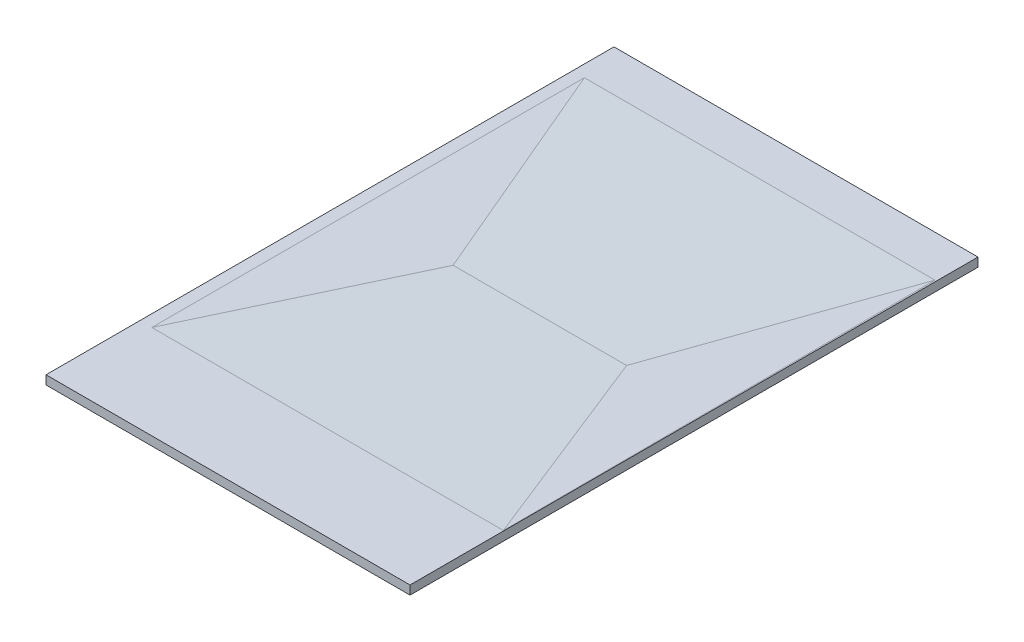
ISO-10303-21;
HEADER;
FILE_DESCRIPTION(('STEP AP214'),'2;1');
FILE_NAME('part.step','',(''),(''),'','','');
FILE_SCHEMA(('AUTOMOTIVE_DESIGN { 1 0 10303 214 1 1 1 1 }'));
ENDSEC;
DATA;
#1=APPLICATION_CONTEXT('core data for automotive mechanical design processes');
#2=APPLICATION_PROTOCOL_DEFINITION('international standard','automotive_design',2000,#1);
#3=PRODUCT_CONTEXT('',#1,'mechanical');
#4=PRODUCT('Part','Part','',(#3));
#5=PRODUCT_RELATED_PRODUCT_CATEGORY('part','',(#4));
#6=PRODUCT_DEFINITION_FORMATION('','',#4);
#7=PRODUCT_DEFINITION_CONTEXT('part definition',#1,'design');
#8=PRODUCT_DEFINITION('design','',#6,#7);
#9=PRODUCT_DEFINITION_SHAPE('','',#8);
#10=(LENGTH_UNIT() NAMED_UNIT(*) SI_UNIT(.MILLI.,.METRE.));
#11=(NAMED_UNIT(*) PLANE_ANGLE_UNIT() SI_UNIT($,.RADIAN.));
#12=(NAMED_UNIT(*) SI_UNIT($,.STERADIAN.) SOLID_ANGLE_UNIT());
#13=UNCERTAINTY_MEASURE_WITH_UNIT(LENGTH_MEASURE(1.E-05),#10,'distance_accuracy_value','');
#14=(GEOMETRIC_REPRESENTATION_CONTEXT(3) GLOBAL_UNCERTAINTY_ASSIGNED_CONTEXT((#13)) GLOBAL_UNIT_ASSIGNED_CONTEXT((#10,
#11,#12)) REPRESENTATION_CONTEXT('',''));
#15=CARTESIAN_POINT('',(0.,0.,0.));
#16=DIRECTION('',(0.,0.,1.));
#17=DIRECTION('',(1.,0.,0.));
#18=AXIS2_PLACEMENT_3D('',#15,#16,#17);
#19=CARTESIAN_POINT('',(-1695.2888489925,500.,4954.63050108021));
#20=DIRECTION('',(0.,1.,0.));
#21=DIRECTION('',(0.,0.,1.));
#22=AXIS2_PLACEMENT_3D('',#19,#20,#21);
#23=PLANE('',#22);
#24=DIRECTION('',(-1.,0.,0.));
#25=VECTOR('',#24,1.);
#26=CARTESIAN_POINT('',(-1695.28884899251,500.,-27195.3694989198));
#27=LINE('',#26,#25);
#28=CARTESIAN_POINT('',(18754.7111510075,500.,-27195.3694989198));
#29=VERTEX_POINT('',#28);
#30=CARTESIAN_POINT('',(-1851.31338681455,500.,-27195.3694989198));
#31=VERTEX_POINT('',#30);
#32=EDGE_CURVE('E96',#29,#31,#27,.T.);
#33=ORIENTED_EDGE('',*,*,#32,.T.);
#34=DIRECTION('',(0.,0.,1.));
#35=VECTOR('',#34,1.);
#36=CARTESIAN_POINT('',(-1851.31338681455,500.,-27195.3694989198));
#37=LINE('',#36,#35);
#38=CARTESIAN_POINT('',(-1851.31338681455,500.,4954.63050108021));
#39=VERTEX_POINT('',#38);
#40=EDGE_CURVE('E227',#31,#39,#37,.T.);
#41=ORIENTED_EDGE('',*,*,#40,.T.);
#42=DIRECTION('',(1.,0.,0.));
#43=VECTOR('',#42,1.);
#44=CARTESIAN_POINT('',(-1695.2888489925,500.,4954.63050108021));
#45=LINE('',#44,#43);
#46=CARTESIAN_POINT('',(18754.7111510075,500.,4954.63050108021));
#47=VERTEX_POINT('',#46);
#48=EDGE_CURVE('E102',#39,#47,#45,.T.);
#49=ORIENTED_EDGE('',*,*,#48,.T.);
#50=DIRECTION('',(0.,0.,-1.));
#51=VECTOR('',#50,1.);
#52=CARTESIAN_POINT('',(18754.7111510075,500.,-27195.3694989198));
#53=LINE('',#52,#51);
#54=EDGE_CURVE('E67',#47,#29,#53,.T.);
#55=ORIENTED_EDGE('',*,*,#54,.T.);
#56=EDGE_LOOP('',(#33,#41,#49,#55));
#57=FACE_BOUND('',#56,.T.);
#58=DIRECTION('',(-0.00235029524042429,0.,-0.999997238052327));
#59=VECTOR('',#58,1.);
#60=CARTESIAN_POINT('',(18725.861161739,500.,-358.369498919796));
#61=LINE('',#60,#59);
#62=CARTESIAN_POINT('',(18725.861161739,500.,-358.369498919796));
#63=VERTEX_POINT('',#62);
#64=CARTESIAN_POINT('',(18668.3093232316,500.,-24845.3694989198));
#65=VERTEX_POINT('',#64);
#66=EDGE_CURVE('E149',#63,#65,#61,.T.);
#67=ORIENTED_EDGE('',*,*,#66,.F.);
#68=CARTESIAN_POINT('',(-1175.2888489925,500.,-358.369498919791));
#69=DIRECTION('',(1.,0.,0.));
#70=VECTOR('',#69,1.);
#71=LINE('',#68,#70);
#72=CARTESIAN_POINT('',(-1175.2888489925,500.,-358.369498919791));
#73=VERTEX_POINT('',#72);
#74=EDGE_CURVE('E159',#73,#63,#71,.T.);
#75=ORIENTED_EDGE('',*,*,#74,.F.);
#76=DIRECTION('',(0.,0.,-1.));
#77=VECTOR('',#76,1.);
#78=CARTESIAN_POINT('',(-1175.2888489925,500.,-358.369498919791));
#79=LINE('',#78,#77);
#80=CARTESIAN_POINT('',(-1175.2888489925,500.,-24845.3694989198));
#81=VERTEX_POINT('',#80);
#82=EDGE_CURVE('E162',#73,#81,#79,.T.);
#83=ORIENTED_EDGE('',*,*,#82,.T.);
#84=CARTESIAN_POINT('',(-1175.2888489925,500.,-24845.3694989198));
#85=DIRECTION('',(1.,0.,0.));
#86=VECTOR('',#85,1.);
#87=LINE('',#84,#86);
#88=EDGE_CURVE('E112',#81,#65,#87,.T.);
#89=ORIENTED_EDGE('',*,*,#88,.T.);
#90=EDGE_LOOP('',(#67,#75,#83,#89));
#91=FACE_BOUND('',#90,.T.);
#92=ADVANCED_FACE('F39',(#57,#91),#23,.T.);
#93=CARTESIAN_POINT('',(-1695.2888489925,500.,4954.63050108021));
#94=DIRECTION('',(0.,0.,-1.));
#95=DIRECTION('',(-1.,0.,0.));
#96=AXIS2_PLACEMENT_3D('',#93,#94,#95);
#97=PLANE('',#96);
#98=DIRECTION('',(1.,0.,0.));
#99=VECTOR('',#98,1.);
#100=CARTESIAN_POINT('',(-1695.2888489925,0.,4954.63050108021));
#101=LINE('',#100,#99);
#102=CARTESIAN_POINT('',(-1851.31338681455,0.,4954.63050108022));
#103=VERTEX_POINT('',#102);
#104=CARTESIAN_POINT('',(18754.7111510075,0.,4954.63050108021));
#105=VERTEX_POINT('',#104);
#106=EDGE_CURVE('E88',#103,#105,#101,.T.);
#107=ORIENTED_EDGE('',*,*,#106,.T.);
#108=DIRECTION('',(0.,-1.,0.));
#109=VECTOR('',#108,1.);
#110=CARTESIAN_POINT('',(18754.7111510075,500.,4954.63050108021));
#111=LINE('',#110,#109);
#112=EDGE_CURVE('E12',#47,#105,#111,.T.);
#113=ORIENTED_EDGE('',*,*,#112,.F.);
#114=ORIENTED_EDGE('',*,*,#48,.F.);
#115=DIRECTION('',(0.,1.,0.));
#116=VECTOR('',#115,1.);
#117=CARTESIAN_POINT('',(-1851.31338681455,-32150.3785927383,4954.63050108021));
#118=LINE('',#117,#116);
#119=EDGE_CURVE('E226',#103,#39,#118,.T.);
#120=ORIENTED_EDGE('',*,*,#119,.F.);
#121=EDGE_LOOP('',(#107,#113,#114,#120));
#122=FACE_BOUND('',#121,.T.);
#123=ADVANCED_FACE('F41',(#122),#97,.F.);
#124=CARTESIAN_POINT('',(18754.7111510075,500.,-27195.3694989198));
#125=DIRECTION('',(-1.,0.,0.));
#126=DIRECTION('',(0.,0.,1.));
#127=AXIS2_PLACEMENT_3D('',#124,#125,#126);
#128=PLANE('',#127);
#129=DIRECTION('',(0.,0.,-1.));
#130=VECTOR('',#129,1.);
#131=CARTESIAN_POINT('',(18754.7111510075,0.,-27195.3694989198));
#132=LINE('',#131,#130);
#133=CARTESIAN_POINT('',(18754.7111510075,0.,-27195.3694989198));
#134=VERTEX_POINT('',#133);
#135=EDGE_CURVE('E79',#105,#134,#132,.T.);
#136=ORIENTED_EDGE('',*,*,#135,.T.);
#137=DIRECTION('',(0.,-1.,0.));
#138=VECTOR('',#137,1.);
#139=CARTESIAN_POINT('',(18754.7111510075,500.,-27195.3694989198));
#140=LINE('',#139,#138);
#141=EDGE_CURVE('E49',#29,#134,#140,.T.);
#142=ORIENTED_EDGE('',*,*,#141,.F.);
#143=ORIENTED_EDGE('',*,*,#54,.F.);
#144=ORIENTED_EDGE('',*,*,#112,.T.);
#145=EDGE_LOOP('',(#136,#142,#143,#144));
#146=FACE_BOUND('',#145,.T.);
#147=ADVANCED_FACE('F81',(#146),#128,.F.);
#148=CARTESIAN_POINT('',(-1695.28884899251,500.,-27195.3694989198));
#149=DIRECTION('',(0.,0.,1.));
#150=DIRECTION('',(1.,0.,0.));
#151=AXIS2_PLACEMENT_3D('',#148,#149,#150);
#152=PLANE('',#151);
#153=DIRECTION('',(-1.,0.,0.));
#154=VECTOR('',#153,1.);
#155=CARTESIAN_POINT('',(-1695.28884899251,0.,-27195.3694989198));
#156=LINE('',#155,#154);
#157=CARTESIAN_POINT('',(-1851.31338681455,0.,-27195.3694989198));
#158=VERTEX_POINT('',#157);
#159=EDGE_CURVE('E87',#134,#158,#156,.T.);
#160=ORIENTED_EDGE('',*,*,#159,.T.);
#161=DIRECTION('',(0.,1.,0.));
#162=VECTOR('',#161,1.);
#163=CARTESIAN_POINT('',(-1851.31338681455,-32150.3785927383,-27195.3694989198));
#164=LINE('',#163,#162);
#165=EDGE_CURVE('E230',#158,#31,#164,.T.);
#166=ORIENTED_EDGE('',*,*,#165,.T.);
#167=ORIENTED_EDGE('',*,*,#32,.F.);
#168=ORIENTED_EDGE('',*,*,#141,.T.);
#169=EDGE_LOOP('',(#160,#166,#167,#168));
#170=FACE_BOUND('',#169,.T.);
#171=ADVANCED_FACE('F92',(#170),#152,.F.);
#172=CARTESIAN_POINT('',(-1695.2888489925,0.,4954.63050108021));
#173=DIRECTION('',(0.,1.,0.));
#174=DIRECTION('',(0.,0.,1.));
#175=AXIS2_PLACEMENT_3D('',#172,#173,#174);
#176=PLANE('',#175);
#177=ORIENTED_EDGE('',*,*,#106,.F.);
#178=DIRECTION('',(0.,0.,-1.));
#179=VECTOR('',#178,1.);
#180=CARTESIAN_POINT('',(-1851.31338681455,0.,-27195.3694989198));
#181=LINE('',#180,#179);
#182=EDGE_CURVE('E100',#103,#158,#181,.T.);
#183=ORIENTED_EDGE('',*,*,#182,.T.);
#184=ORIENTED_EDGE('',*,*,#159,.F.);
#185=ORIENTED_EDGE('',*,*,#135,.F.);
#186=EDGE_LOOP('',(#177,#183,#184,#185));
#187=FACE_BOUND('',#186,.T.);
#188=ADVANCED_FACE('F98',(#187),#176,.F.);
#189=CARTESIAN_POINT('',(-1851.31338681455,-32150.3785927383,-27195.3694989198));
#190=DIRECTION('',(-1.,0.,0.));
#191=DIRECTION('',(0.,0.,1.));
#192=AXIS2_PLACEMENT_3D('',#189,#190,#191);
#193=PLANE('',#192);
#194=ORIENTED_EDGE('',*,*,#182,.F.);
#195=ORIENTED_EDGE('',*,*,#119,.T.);
#196=ORIENTED_EDGE('',*,*,#40,.F.);
#197=ORIENTED_EDGE('',*,*,#165,.F.);
#198=EDGE_LOOP('',(#194,#195,#196,#197));
#199=FACE_BOUND('',#198,.T.);
#200=ADVANCED_FACE('F127',(#199),#193,.T.);
#201=CARTESIAN_POINT('',(11.9040058686577,-284.11710465999,-0.0279780056088759));
#202=DIRECTION('',(-0.0418615100453982,0.999123417950296,9.83871795569129E-05));
#203=DIRECTION('',(-0.999123422786072,-0.0418615102480087,0.));
#204=AXIS2_PLACEMENT_3D('',#201,#202,#203);
#205=PLANE('',#204);
#206=DIRECTION('',(-0.377460132818202,-0.0157237383532905,-0.925892332933513));
#207=VECTOR('',#206,1.);
#208=CARTESIAN_POINT('',(18725.861161739,500.,-358.369498919796));
#209=LINE('',#208,#207);
#210=CARTESIAN_POINT('',(13924.7111510075,300.,-12135.3694989198));
#211=VERTEX_POINT('',#210);
#212=EDGE_CURVE('E43',#63,#211,#209,.T.);
#213=ORIENTED_EDGE('',*,*,#212,.F.);
#214=ORIENTED_EDGE('',*,*,#66,.T.);
#215=DIRECTION('',(-0.349621168992958,-0.0147407582303302,0.936775185537487));
#216=VECTOR('',#215,1.);
#217=CARTESIAN_POINT('',(18668.3093232316,500.,-24845.3694989198));
#218=LINE('',#217,#216);
#219=EDGE_CURVE('E57',#65,#211,#218,.T.);
#220=ORIENTED_EDGE('',*,*,#219,.T.);
#221=EDGE_LOOP('',(#213,#214,#220));
#222=FACE_BOUND('',#221,.T.);
#223=ADVANCED_FACE('F192',(#222),#205,.T.);
#224=CARTESIAN_POINT('',(17.2303678538873,454.822985089338,0.));
#225=DIRECTION('',(0.0378565231546383,0.999283184915388,0.));
#226=DIRECTION('',(-0.999283184915388,0.0378565231546383,0.));
#227=AXIS2_PLACEMENT_3D('',#224,#225,#226);
#228=PLANE('',#227);
#229=DIRECTION('',(0.409005088724965,-0.0154946173871549,-0.912400544842619));
#230=VECTOR('',#229,1.);
#231=CARTESIAN_POINT('',(-1175.2888489925,500.,-358.369498919791));
#232=LINE('',#231,#230);
#233=CARTESIAN_POINT('',(4104.02949111742,300.,-12135.3694989198));
#234=VERTEX_POINT('',#233);
#235=EDGE_CURVE('E169',#73,#234,#232,.T.);
#236=ORIENTED_EDGE('',*,*,#235,.T.);
#237=DIRECTION('',(-0.383552191486169,0.0145303680049793,-0.923404886716438));
#238=VECTOR('',#237,1.);
#239=CARTESIAN_POINT('',(4104.02949111742,300.,-12135.3694989198));
#240=LINE('',#239,#238);
#241=EDGE_CURVE('E172',#234,#81,#240,.T.);
#242=ORIENTED_EDGE('',*,*,#241,.T.);
#243=ORIENTED_EDGE('',*,*,#82,.F.);
#244=EDGE_LOOP('',(#236,#242,#243));
#245=FACE_BOUND('',#244,.T.);
#246=ADVANCED_FACE('F201',(#245),#228,.T.);
#247=CARTESIAN_POINT('',(0.,505.94001014501,-8.59200153086543));
#248=DIRECTION('',(0.,0.999855832714569,-0.0169798052596513));
#249=DIRECTION('',(0.,0.0169798052596514,0.999855832714569));
#250=AXIS2_PLACEMENT_3D('',#247,#248,#249);
#251=PLANE('',#250);
#252=CARTESIAN_POINT('',(4104.02949111742,300.,-12135.3694989198));
#253=DIRECTION('',(1.,0.,0.));
#254=VECTOR('',#253,1.);
#255=LINE('',#252,#254);
#256=EDGE_CURVE('E170',#234,#211,#255,.T.);
#257=ORIENTED_EDGE('',*,*,#256,.F.);
#258=ORIENTED_EDGE('',*,*,#235,.F.);
#259=ORIENTED_EDGE('',*,*,#74,.T.);
#260=ORIENTED_EDGE('',*,*,#212,.T.);
#261=EDGE_LOOP('',(#257,#258,#259,#260));
#262=FACE_BOUND('',#261,.T.);
#263=ADVANCED_FACE('F276',(#262),#251,.T.);
#264=CARTESIAN_POINT('',(0.,109.015186108942,1.71542385694637));
#265=DIRECTION('',(0.,-0.999876217784431,-0.0157336934348455));
#266=DIRECTION('',(0.,0.0157336934348455,-0.999876217784431));
#267=AXIS2_PLACEMENT_3D('',#264,#265,#266);
#268=PLANE('',#267);
#269=ORIENTED_EDGE('',*,*,#88,.F.);
#270=ORIENTED_EDGE('',*,*,#241,.F.);
#271=ORIENTED_EDGE('',*,*,#256,.T.);
#272=ORIENTED_EDGE('',*,*,#219,.F.);
#273=EDGE_LOOP('',(#269,#270,#271,#272));
#274=FACE_BOUND('',#273,.T.);
#275=ADVANCED_FACE('F202',(#274),#268,.F.);
#276=CLOSED_SHELL('',(#92,#123,#147,#171,#188,#200,#223,#246,#263,#275));
#277=MANIFOLD_SOLID_BREP('B2',#276);
#278=ADVANCED_BREP_SHAPE_REPRESENTATION('',(#18,#277),#14);
#279=SHAPE_DEFINITION_REPRESENTATION(#9,#278);
ENDSEC;
END-ISO-10303-21;
